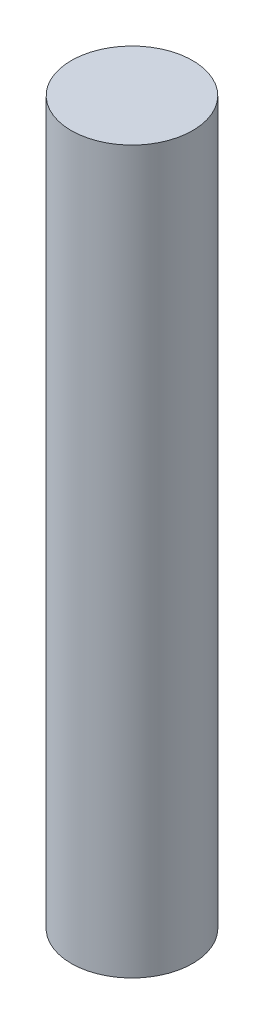
ISO-10303-21;
HEADER;
FILE_DESCRIPTION(('STEP AP214'),'2;1');
FILE_NAME('part.step','',(''),(''),'','','');
FILE_SCHEMA(('AUTOMOTIVE_DESIGN { 1 0 10303 214 1 1 1 1 }'));
ENDSEC;
DATA;
#1=APPLICATION_CONTEXT('core data for automotive mechanical design processes');
#2=APPLICATION_PROTOCOL_DEFINITION('international standard','automotive_design',2000,#1);
#3=PRODUCT_CONTEXT('',#1,'mechanical');
#4=PRODUCT('Part','Part','',(#3));
#5=PRODUCT_RELATED_PRODUCT_CATEGORY('part','',(#4));
#6=PRODUCT_DEFINITION_FORMATION('','',#4);
#7=PRODUCT_DEFINITION_CONTEXT('part definition',#1,'design');
#8=PRODUCT_DEFINITION('design','',#6,#7);
#9=PRODUCT_DEFINITION_SHAPE('','',#8);
#10=(LENGTH_UNIT() NAMED_UNIT(*) SI_UNIT(.MILLI.,.METRE.));
#11=(NAMED_UNIT(*) PLANE_ANGLE_UNIT() SI_UNIT($,.RADIAN.));
#12=(NAMED_UNIT(*) SI_UNIT($,.STERADIAN.) SOLID_ANGLE_UNIT());
#13=UNCERTAINTY_MEASURE_WITH_UNIT(LENGTH_MEASURE(1.E-05),#10,'distance_accuracy_value','');
#14=(GEOMETRIC_REPRESENTATION_CONTEXT(3) GLOBAL_UNCERTAINTY_ASSIGNED_CONTEXT((#13)) GLOBAL_UNIT_ASSIGNED_CONTEXT((#10,
#11,#12)) REPRESENTATION_CONTEXT('',''));
#15=CARTESIAN_POINT('',(0.,0.,0.));
#16=DIRECTION('',(0.,0.,1.));
#17=DIRECTION('',(1.,0.,0.));
#18=AXIS2_PLACEMENT_3D('',#15,#16,#17);
#19=CARTESIAN_POINT('',(0.,41.,0.));
#20=DIRECTION('',(0.,-1.,0.));
#21=DIRECTION('',(0.,0.,-1.));
#22=AXIS2_PLACEMENT_3D('',#19,#20,#21);
#23=CYLINDRICAL_SURFACE('',#22,3.45);
#24=CARTESIAN_POINT('',(0.,41.,0.));
#25=DIRECTION('',(0.,1.,0.));
#26=DIRECTION('',(0.,0.,1.));
#27=AXIS2_PLACEMENT_3D('',#24,#25,#26);
#28=CIRCLE('',#27,3.45);
#29=CARTESIAN_POINT('',(0.,41.,3.45));
#30=VERTEX_POINT('',#29);
#31=EDGE_CURVE('E10',#30,#30,#28,.T.);
#32=ORIENTED_EDGE('',*,*,#31,.F.);
#33=EDGE_LOOP('',(#32));
#34=FACE_BOUND('',#33,.T.);
#35=CARTESIAN_POINT('',(0.,0.,0.));
#36=DIRECTION('',(0.,1.,0.));
#37=DIRECTION('',(0.,0.,1.));
#38=AXIS2_PLACEMENT_3D('',#35,#36,#37);
#39=CIRCLE('',#38,3.45);
#40=CARTESIAN_POINT('',(0.,0.,3.45));
#41=VERTEX_POINT('',#40);
#42=EDGE_CURVE('E34',#41,#41,#39,.T.);
#43=ORIENTED_EDGE('',*,*,#42,.T.);
#44=EDGE_LOOP('',(#43));
#45=FACE_BOUND('',#44,.T.);
#46=ADVANCED_FACE('F31',(#34,#45),#23,.T.);
#47=CARTESIAN_POINT('',(0.,41.,0.));
#48=DIRECTION('',(0.,1.,0.));
#49=DIRECTION('',(0.,0.,1.));
#50=AXIS2_PLACEMENT_3D('',#47,#48,#49);
#51=PLANE('',#50);
#52=ORIENTED_EDGE('',*,*,#31,.T.);
#53=EDGE_LOOP('',(#52));
#54=FACE_BOUND('',#53,.T.);
#55=ADVANCED_FACE('F46',(#54),#51,.T.);
#56=CARTESIAN_POINT('',(0.,0.,0.));
#57=DIRECTION('',(0.,1.,0.));
#58=DIRECTION('',(0.,0.,1.));
#59=AXIS2_PLACEMENT_3D('',#56,#57,#58);
#60=PLANE('',#59);
#61=ORIENTED_EDGE('',*,*,#42,.F.);
#62=EDGE_LOOP('',(#61));
#63=FACE_BOUND('',#62,.T.);
#64=ADVANCED_FACE('F44',(#63),#60,.F.);
#65=CLOSED_SHELL('',(#46,#55,#64));
#66=MANIFOLD_SOLID_BREP('B2',#65);
#67=ADVANCED_BREP_SHAPE_REPRESENTATION('',(#18,#66),#14);
#68=SHAPE_DEFINITION_REPRESENTATION(#9,#67);
ENDSEC;
END-ISO-10303-21;
